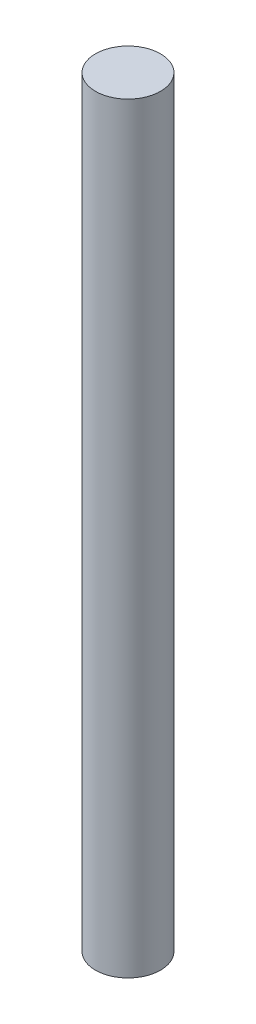
ISO-10303-21;
HEADER;
FILE_DESCRIPTION(('STEP AP214'),'2;1');
FILE_NAME('part.step','',(''),(''),'','','');
FILE_SCHEMA(('AUTOMOTIVE_DESIGN { 1 0 10303 214 1 1 1 1 }'));
ENDSEC;
DATA;
#1=APPLICATION_CONTEXT('core data for automotive mechanical design processes');
#2=APPLICATION_PROTOCOL_DEFINITION('international standard','automotive_design',2000,#1);
#3=PRODUCT_CONTEXT('',#1,'mechanical');
#4=PRODUCT('Part','Part','',(#3));
#5=PRODUCT_RELATED_PRODUCT_CATEGORY('part','',(#4));
#6=PRODUCT_DEFINITION_FORMATION('','',#4);
#7=PRODUCT_DEFINITION_CONTEXT('part definition',#1,'design');
#8=PRODUCT_DEFINITION('design','',#6,#7);
#9=PRODUCT_DEFINITION_SHAPE('','',#8);
#10=(LENGTH_UNIT() NAMED_UNIT(*) SI_UNIT(.MILLI.,.METRE.));
#11=(NAMED_UNIT(*) PLANE_ANGLE_UNIT() SI_UNIT($,.RADIAN.));
#12=(NAMED_UNIT(*) SI_UNIT($,.STERADIAN.) SOLID_ANGLE_UNIT());
#13=UNCERTAINTY_MEASURE_WITH_UNIT(LENGTH_MEASURE(1.E-05),#10,'distance_accuracy_value','');
#14=(GEOMETRIC_REPRESENTATION_CONTEXT(3) GLOBAL_UNCERTAINTY_ASSIGNED_CONTEXT((#13)) GLOBAL_UNIT_ASSIGNED_CONTEXT((#10,
#11,#12)) REPRESENTATION_CONTEXT('',''));
#15=CARTESIAN_POINT('',(0.,0.,0.));
#16=DIRECTION('',(0.,0.,1.));
#17=DIRECTION('',(1.,0.,0.));
#18=AXIS2_PLACEMENT_3D('',#15,#16,#17);
#19=CARTESIAN_POINT('',(0.,74.295,0.));
#20=DIRECTION('',(0.,-1.,0.));
#21=DIRECTION('',(0.,0.,-1.));
#22=AXIS2_PLACEMENT_3D('',#19,#20,#21);
#23=CYLINDRICAL_SURFACE('',#22,3.175);
#24=CARTESIAN_POINT('',(0.,74.295,0.));
#25=DIRECTION('',(0.,1.,0.));
#26=DIRECTION('',(0.,0.,1.));
#27=AXIS2_PLACEMENT_3D('',#24,#25,#26);
#28=CIRCLE('',#27,3.175);
#29=CARTESIAN_POINT('',(0.,74.295,3.175));
#30=VERTEX_POINT('',#29);
#31=EDGE_CURVE('E10',#30,#30,#28,.T.);
#32=ORIENTED_EDGE('',*,*,#31,.F.);
#33=EDGE_LOOP('',(#32));
#34=FACE_BOUND('',#33,.T.);
#35=CARTESIAN_POINT('',(0.,0.,0.));
#36=DIRECTION('',(0.,1.,0.));
#37=DIRECTION('',(0.,0.,1.));
#38=AXIS2_PLACEMENT_3D('',#35,#36,#37);
#39=CIRCLE('',#38,3.175);
#40=CARTESIAN_POINT('',(0.,0.,3.175));
#41=VERTEX_POINT('',#40);
#42=EDGE_CURVE('E40',#41,#41,#39,.T.);
#43=ORIENTED_EDGE('',*,*,#42,.T.);
#44=EDGE_LOOP('',(#43));
#45=FACE_BOUND('',#44,.T.);
#46=ADVANCED_FACE('F37',(#34,#45),#23,.T.);
#47=CARTESIAN_POINT('',(0.,74.295,0.));
#48=DIRECTION('',(0.,1.,0.));
#49=DIRECTION('',(0.,0.,1.));
#50=AXIS2_PLACEMENT_3D('',#47,#48,#49);
#51=PLANE('',#50);
#52=ORIENTED_EDGE('',*,*,#31,.T.);
#53=EDGE_LOOP('',(#52));
#54=FACE_BOUND('',#53,.T.);
#55=ADVANCED_FACE('F52',(#54),#51,.T.);
#56=CARTESIAN_POINT('',(0.,0.,0.));
#57=DIRECTION('',(0.,1.,0.));
#58=DIRECTION('',(0.,0.,1.));
#59=AXIS2_PLACEMENT_3D('',#56,#57,#58);
#60=PLANE('',#59);
#61=ORIENTED_EDGE('',*,*,#42,.F.);
#62=EDGE_LOOP('',(#61));
#63=FACE_BOUND('',#62,.T.);
#64=ADVANCED_FACE('F50',(#63),#60,.F.);
#65=CLOSED_SHELL('',(#46,#55,#64));
#66=MANIFOLD_SOLID_BREP('B2',#65);
#67=ADVANCED_BREP_SHAPE_REPRESENTATION('',(#18,#66),#14);
#68=SHAPE_DEFINITION_REPRESENTATION(#9,#67);
ENDSEC;
END-ISO-10303-21;
